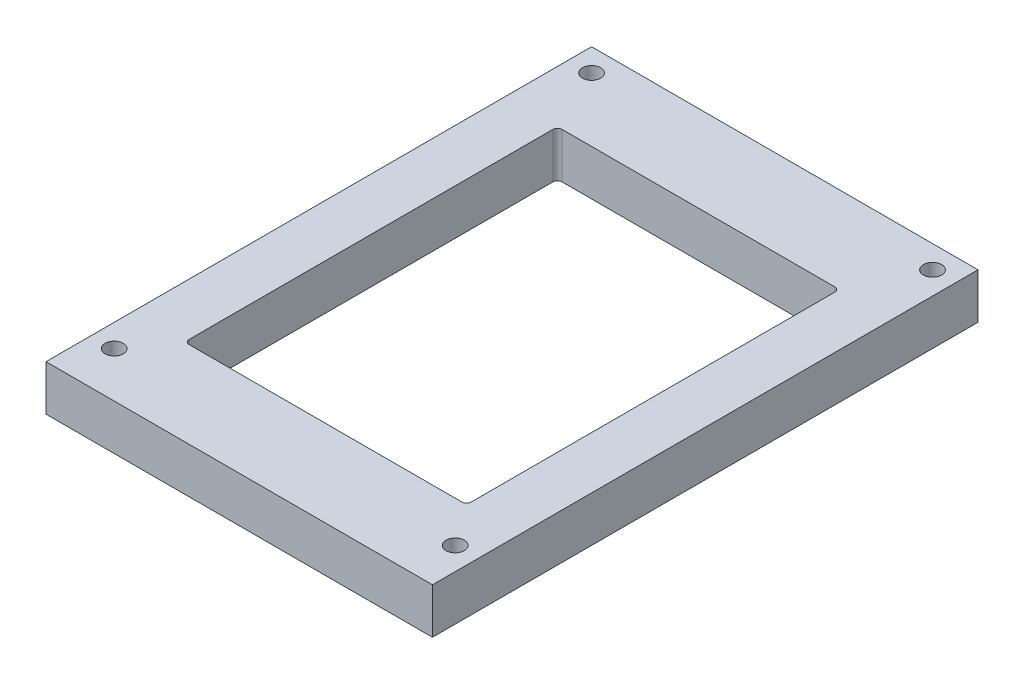
ISO-10303-21;
HEADER;
FILE_DESCRIPTION(('STEP AP214'),'2;1');
FILE_NAME('part.step','',(''),(''),'','','');
FILE_SCHEMA(('AUTOMOTIVE_DESIGN { 1 0 10303 214 1 1 1 1 }'));
ENDSEC;
DATA;
#1=APPLICATION_CONTEXT('core data for automotive mechanical design processes');
#2=APPLICATION_PROTOCOL_DEFINITION('international standard','automotive_design',2000,#1);
#3=PRODUCT_CONTEXT('',#1,'mechanical');
#4=PRODUCT('Part','Part','',(#3));
#5=PRODUCT_RELATED_PRODUCT_CATEGORY('part','',(#4));
#6=PRODUCT_DEFINITION_FORMATION('','',#4);
#7=PRODUCT_DEFINITION_CONTEXT('part definition',#1,'design');
#8=PRODUCT_DEFINITION('design','',#6,#7);
#9=PRODUCT_DEFINITION_SHAPE('','',#8);
#10=(LENGTH_UNIT() NAMED_UNIT(*) SI_UNIT(.MILLI.,.METRE.));
#11=(NAMED_UNIT(*) PLANE_ANGLE_UNIT() SI_UNIT($,.RADIAN.));
#12=(NAMED_UNIT(*) SI_UNIT($,.STERADIAN.) SOLID_ANGLE_UNIT());
#13=UNCERTAINTY_MEASURE_WITH_UNIT(LENGTH_MEASURE(1.E-05),#10,'distance_accuracy_value','');
#14=(GEOMETRIC_REPRESENTATION_CONTEXT(3) GLOBAL_UNCERTAINTY_ASSIGNED_CONTEXT((#13)) GLOBAL_UNIT_ASSIGNED_CONTEXT((#10,
#11,#12)) REPRESENTATION_CONTEXT('',''));
#15=CARTESIAN_POINT('',(0.,0.,0.));
#16=DIRECTION('',(0.,0.,1.));
#17=DIRECTION('',(1.,0.,0.));
#18=AXIS2_PLACEMENT_3D('',#15,#16,#17);
#19=CARTESIAN_POINT('',(42.5,10.,60.));
#20=DIRECTION('',(-1.,0.,0.));
#21=DIRECTION('',(0.,0.,1.));
#22=AXIS2_PLACEMENT_3D('',#19,#20,#21);
#23=PLANE('',#22);
#24=DIRECTION('',(0.,0.,-1.));
#25=VECTOR('',#24,1.);
#26=CARTESIAN_POINT('',(42.5,0.,60.));
#27=LINE('',#26,#25);
#28=CARTESIAN_POINT('',(42.5,0.,60.));
#29=VERTEX_POINT('',#28);
#30=CARTESIAN_POINT('',(42.5,0.,-60.));
#31=VERTEX_POINT('',#30);
#32=EDGE_CURVE('E148',#29,#31,#27,.T.);
#33=ORIENTED_EDGE('',*,*,#32,.T.);
#34=DIRECTION('',(0.,-1.,0.));
#35=VECTOR('',#34,1.);
#36=CARTESIAN_POINT('',(42.5,10.,-60.));
#37=LINE('',#36,#35);
#38=CARTESIAN_POINT('',(42.5,10.,-60.));
#39=VERTEX_POINT('',#38);
#40=EDGE_CURVE('E129',#39,#31,#37,.T.);
#41=ORIENTED_EDGE('',*,*,#40,.F.);
#42=DIRECTION('',(0.,0.,-1.));
#43=VECTOR('',#42,1.);
#44=CARTESIAN_POINT('',(42.5,10.,60.));
#45=LINE('',#44,#43);
#46=CARTESIAN_POINT('',(42.5,10.,60.));
#47=VERTEX_POINT('',#46);
#48=EDGE_CURVE('E136',#47,#39,#45,.T.);
#49=ORIENTED_EDGE('',*,*,#48,.F.);
#50=DIRECTION('',(0.,-1.,0.));
#51=VECTOR('',#50,1.);
#52=CARTESIAN_POINT('',(42.5,10.,60.));
#53=LINE('',#52,#51);
#54=EDGE_CURVE('E222',#47,#29,#53,.T.);
#55=ORIENTED_EDGE('',*,*,#54,.T.);
#56=EDGE_LOOP('',(#33,#41,#49,#55));
#57=FACE_BOUND('',#56,.T.);
#58=ADVANCED_FACE('F36',(#57),#23,.F.);
#59=CARTESIAN_POINT('',(-42.5,10.,-60.));
#60=DIRECTION('',(0.,0.,1.));
#61=DIRECTION('',(1.,0.,0.));
#62=AXIS2_PLACEMENT_3D('',#59,#60,#61);
#63=PLANE('',#62);
#64=DIRECTION('',(-1.,0.,0.));
#65=VECTOR('',#64,1.);
#66=CARTESIAN_POINT('',(-42.5,0.,-60.));
#67=LINE('',#66,#65);
#68=CARTESIAN_POINT('',(-42.5,0.,-60.));
#69=VERTEX_POINT('',#68);
#70=EDGE_CURVE('E224',#31,#69,#67,.T.);
#71=ORIENTED_EDGE('',*,*,#70,.T.);
#72=DIRECTION('',(0.,-1.,0.));
#73=VECTOR('',#72,1.);
#74=CARTESIAN_POINT('',(-42.5,10.,-60.));
#75=LINE('',#74,#73);
#76=CARTESIAN_POINT('',(-42.5,10.,-60.));
#77=VERTEX_POINT('',#76);
#78=EDGE_CURVE('E132',#77,#69,#75,.T.);
#79=ORIENTED_EDGE('',*,*,#78,.F.);
#80=DIRECTION('',(-1.,0.,0.));
#81=VECTOR('',#80,1.);
#82=CARTESIAN_POINT('',(-42.5,10.,-60.));
#83=LINE('',#82,#81);
#84=EDGE_CURVE('E125',#39,#77,#83,.T.);
#85=ORIENTED_EDGE('',*,*,#84,.F.);
#86=ORIENTED_EDGE('',*,*,#40,.T.);
#87=EDGE_LOOP('',(#71,#79,#85,#86));
#88=FACE_BOUND('',#87,.T.);
#89=ADVANCED_FACE('F127',(#88),#63,.F.);
#90=CARTESIAN_POINT('',(-42.5,10.,60.));
#91=DIRECTION('',(1.,0.,0.));
#92=DIRECTION('',(0.,0.,-1.));
#93=AXIS2_PLACEMENT_3D('',#90,#91,#92);
#94=PLANE('',#93);
#95=DIRECTION('',(0.,0.,1.));
#96=VECTOR('',#95,1.);
#97=CARTESIAN_POINT('',(-42.5,0.,60.));
#98=LINE('',#97,#96);
#99=CARTESIAN_POINT('',(-42.5,0.,60.));
#100=VERTEX_POINT('',#99);
#101=EDGE_CURVE('E226',#69,#100,#98,.T.);
#102=ORIENTED_EDGE('',*,*,#101,.T.);
#103=DIRECTION('',(0.,-1.,0.));
#104=VECTOR('',#103,1.);
#105=CARTESIAN_POINT('',(-42.5,10.,60.));
#106=LINE('',#105,#104);
#107=CARTESIAN_POINT('',(-42.5,10.,60.));
#108=VERTEX_POINT('',#107);
#109=EDGE_CURVE('E153',#108,#100,#106,.T.);
#110=ORIENTED_EDGE('',*,*,#109,.F.);
#111=DIRECTION('',(0.,0.,1.));
#112=VECTOR('',#111,1.);
#113=CARTESIAN_POINT('',(-42.5,10.,60.));
#114=LINE('',#113,#112);
#115=EDGE_CURVE('E135',#77,#108,#114,.T.);
#116=ORIENTED_EDGE('',*,*,#115,.F.);
#117=ORIENTED_EDGE('',*,*,#78,.T.);
#118=EDGE_LOOP('',(#102,#110,#116,#117));
#119=FACE_BOUND('',#118,.T.);
#120=ADVANCED_FACE('F238',(#119),#94,.F.);
#121=CARTESIAN_POINT('',(-42.5,10.,60.));
#122=DIRECTION('',(0.,0.,-1.));
#123=DIRECTION('',(-1.,0.,0.));
#124=AXIS2_PLACEMENT_3D('',#121,#122,#123);
#125=PLANE('',#124);
#126=DIRECTION('',(1.,0.,0.));
#127=VECTOR('',#126,1.);
#128=CARTESIAN_POINT('',(-42.5,0.,60.));
#129=LINE('',#128,#127);
#130=EDGE_CURVE('E145',#100,#29,#129,.T.);
#131=ORIENTED_EDGE('',*,*,#130,.T.);
#132=ORIENTED_EDGE('',*,*,#54,.F.);
#133=DIRECTION('',(1.,0.,0.));
#134=VECTOR('',#133,1.);
#135=CARTESIAN_POINT('',(-42.5,10.,60.));
#136=LINE('',#135,#134);
#137=EDGE_CURVE('E141',#108,#47,#136,.T.);
#138=ORIENTED_EDGE('',*,*,#137,.F.);
#139=ORIENTED_EDGE('',*,*,#109,.T.);
#140=EDGE_LOOP('',(#131,#132,#138,#139));
#141=FACE_BOUND('',#140,.T.);
#142=ADVANCED_FACE('F233',(#141),#125,.F.);
#143=CARTESIAN_POINT('',(0.,10.,0.));
#144=DIRECTION('',(0.,-1.,0.));
#145=DIRECTION('',(0.,0.,-1.));
#146=AXIS2_PLACEMENT_3D('',#143,#144,#145);
#147=PLANE('',#146);
#148=CARTESIAN_POINT('',(37.5,10.,50.));
#149=DIRECTION('',(0.,1.,0.));
#150=DIRECTION('',(0.,0.,1.));
#151=AXIS2_PLACEMENT_3D('',#148,#149,#150);
#152=CIRCLE('',#151,2.);
#153=CARTESIAN_POINT('',(37.5,10.,52.));
#154=VERTEX_POINT('',#153);
#155=EDGE_CURVE('E316',#154,#154,#152,.T.);
#156=ORIENTED_EDGE('',*,*,#155,.F.);
#157=EDGE_LOOP('',(#156));
#158=FACE_BOUND('',#157,.T.);
#159=CARTESIAN_POINT('',(37.5,10.,-55.));
#160=DIRECTION('',(0.,1.,0.));
#161=DIRECTION('',(0.,0.,1.));
#162=AXIS2_PLACEMENT_3D('',#159,#160,#161);
#163=CIRCLE('',#162,2.);
#164=CARTESIAN_POINT('',(37.5,10.,-53.));
#165=VERTEX_POINT('',#164);
#166=EDGE_CURVE('E338',#165,#165,#163,.T.);
#167=ORIENTED_EDGE('',*,*,#166,.F.);
#168=EDGE_LOOP('',(#167));
#169=FACE_BOUND('',#168,.T.);
#170=CARTESIAN_POINT('',(-37.5,10.,-55.));
#171=DIRECTION('',(0.,1.,0.));
#172=DIRECTION('',(0.,0.,1.));
#173=AXIS2_PLACEMENT_3D('',#170,#171,#172);
#174=CIRCLE('',#173,2.);
#175=CARTESIAN_POINT('',(-37.5,10.,-53.));
#176=VERTEX_POINT('',#175);
#177=EDGE_CURVE('E332',#176,#176,#174,.T.);
#178=ORIENTED_EDGE('',*,*,#177,.F.);
#179=EDGE_LOOP('',(#178));
#180=FACE_BOUND('',#179,.T.);
#181=CARTESIAN_POINT('',(-37.5,10.,50.));
#182=DIRECTION('',(0.,1.,0.));
#183=DIRECTION('',(0.,0.,1.));
#184=AXIS2_PLACEMENT_3D('',#181,#182,#183);
#185=CIRCLE('',#184,2.);
#186=CARTESIAN_POINT('',(-37.5,10.,52.));
#187=VERTEX_POINT('',#186);
#188=EDGE_CURVE('E331',#187,#187,#185,.T.);
#189=ORIENTED_EDGE('',*,*,#188,.F.);
#190=EDGE_LOOP('',(#189));
#191=FACE_BOUND('',#190,.T.);
#192=DIRECTION('',(-1.,0.,0.));
#193=VECTOR('',#192,1.);
#194=CARTESIAN_POINT('',(-31.,10.,-41.));
#195=LINE('',#194,#193);
#196=CARTESIAN_POINT('',(30.,10.,-41.));
#197=VERTEX_POINT('',#196);
#198=CARTESIAN_POINT('',(-30.,10.,-41.));
#199=VERTEX_POINT('',#198);
#200=EDGE_CURVE('E189',#197,#199,#195,.T.);
#201=ORIENTED_EDGE('',*,*,#200,.F.);
#202=CARTESIAN_POINT('',(30.,10.,-40.));
#203=DIRECTION('',(0.,-1.,0.));
#204=DIRECTION('',(0.,0.,-1.));
#205=AXIS2_PLACEMENT_3D('',#202,#203,#204);
#206=CIRCLE('',#205,1.);
#207=CARTESIAN_POINT('',(31.,10.,-40.));
#208=VERTEX_POINT('',#207);
#209=EDGE_CURVE('E44',#197,#208,#206,.T.);
#210=ORIENTED_EDGE('',*,*,#209,.T.);
#211=DIRECTION('',(0.,0.,-1.));
#212=VECTOR('',#211,1.);
#213=CARTESIAN_POINT('',(31.,10.,41.));
#214=LINE('',#213,#212);
#215=CARTESIAN_POINT('',(31.,10.,40.));
#216=VERTEX_POINT('',#215);
#217=EDGE_CURVE('E188',#216,#208,#214,.T.);
#218=ORIENTED_EDGE('',*,*,#217,.F.);
#219=CARTESIAN_POINT('',(30.,10.,40.));
#220=DIRECTION('',(0.,-1.,0.));
#221=DIRECTION('',(0.,0.,-1.));
#222=AXIS2_PLACEMENT_3D('',#219,#220,#221);
#223=CIRCLE('',#222,1.);
#224=CARTESIAN_POINT('',(30.,10.,41.));
#225=VERTEX_POINT('',#224);
#226=EDGE_CURVE('E173',#216,#225,#223,.T.);
#227=ORIENTED_EDGE('',*,*,#226,.T.);
#228=DIRECTION('',(1.,0.,0.));
#229=VECTOR('',#228,1.);
#230=CARTESIAN_POINT('',(-31.,10.,41.));
#231=LINE('',#230,#229);
#232=CARTESIAN_POINT('',(-30.,10.,41.));
#233=VERTEX_POINT('',#232);
#234=EDGE_CURVE('E208',#233,#225,#231,.T.);
#235=ORIENTED_EDGE('',*,*,#234,.F.);
#236=CARTESIAN_POINT('',(-30.,10.,40.));
#237=DIRECTION('',(0.,-1.,0.));
#238=DIRECTION('',(0.,0.,-1.));
#239=AXIS2_PLACEMENT_3D('',#236,#237,#238);
#240=CIRCLE('',#239,1.);
#241=CARTESIAN_POINT('',(-31.,10.,40.));
#242=VERTEX_POINT('',#241);
#243=EDGE_CURVE('E177',#233,#242,#240,.T.);
#244=ORIENTED_EDGE('',*,*,#243,.T.);
#245=DIRECTION('',(0.,0.,1.));
#246=VECTOR('',#245,1.);
#247=CARTESIAN_POINT('',(-31.,10.,41.));
#248=LINE('',#247,#246);
#249=CARTESIAN_POINT('',(-31.,10.,-40.));
#250=VERTEX_POINT('',#249);
#251=EDGE_CURVE('E215',#250,#242,#248,.T.);
#252=ORIENTED_EDGE('',*,*,#251,.F.);
#253=CARTESIAN_POINT('',(-30.,10.,-40.));
#254=DIRECTION('',(0.,-1.,0.));
#255=DIRECTION('',(0.,0.,-1.));
#256=AXIS2_PLACEMENT_3D('',#253,#254,#255);
#257=CIRCLE('',#256,1.);
#258=EDGE_CURVE('E181',#250,#199,#257,.T.);
#259=ORIENTED_EDGE('',*,*,#258,.T.);
#260=EDGE_LOOP('',(#201,#210,#218,#227,#235,#244,#252,#259));
#261=FACE_BOUND('',#260,.T.);
#262=ORIENTED_EDGE('',*,*,#48,.T.);
#263=ORIENTED_EDGE('',*,*,#84,.T.);
#264=ORIENTED_EDGE('',*,*,#115,.T.);
#265=ORIENTED_EDGE('',*,*,#137,.T.);
#266=EDGE_LOOP('',(#262,#263,#264,#265));
#267=FACE_BOUND('',#266,.T.);
#268=ADVANCED_FACE('F139',(#158,#169,#180,#191,#261,#267),#147,.F.);
#269=CARTESIAN_POINT('',(0.,0.,0.));
#270=DIRECTION('',(0.,-1.,0.));
#271=DIRECTION('',(0.,0.,-1.));
#272=AXIS2_PLACEMENT_3D('',#269,#270,#271);
#273=PLANE('',#272);
#274=CARTESIAN_POINT('',(-37.5,0.,-55.));
#275=DIRECTION('',(0.,1.,0.));
#276=DIRECTION('',(0.,0.,1.));
#277=AXIS2_PLACEMENT_3D('',#274,#275,#276);
#278=CIRCLE('',#277,0.999999999999998);
#279=CARTESIAN_POINT('',(-37.5,0.,-54.));
#280=VERTEX_POINT('',#279);
#281=EDGE_CURVE('E303',#280,#280,#278,.T.);
#282=ORIENTED_EDGE('',*,*,#281,.T.);
#283=EDGE_LOOP('',(#282));
#284=FACE_BOUND('',#283,.T.);
#285=CARTESIAN_POINT('',(37.5,0.,-55.));
#286=DIRECTION('',(0.,1.,0.));
#287=DIRECTION('',(0.,0.,1.));
#288=AXIS2_PLACEMENT_3D('',#285,#286,#287);
#289=CIRCLE('',#288,0.999999999999998);
#290=CARTESIAN_POINT('',(37.5,0.,-54.));
#291=VERTEX_POINT('',#290);
#292=EDGE_CURVE('E307',#291,#291,#289,.T.);
#293=ORIENTED_EDGE('',*,*,#292,.T.);
#294=EDGE_LOOP('',(#293));
#295=FACE_BOUND('',#294,.T.);
#296=CARTESIAN_POINT('',(37.5,0.,50.));
#297=DIRECTION('',(0.,1.,0.));
#298=DIRECTION('',(0.,0.,1.));
#299=AXIS2_PLACEMENT_3D('',#296,#297,#298);
#300=CIRCLE('',#299,0.999999999999998);
#301=CARTESIAN_POINT('',(37.5,0.,51.));
#302=VERTEX_POINT('',#301);
#303=EDGE_CURVE('E311',#302,#302,#300,.T.);
#304=ORIENTED_EDGE('',*,*,#303,.T.);
#305=EDGE_LOOP('',(#304));
#306=FACE_BOUND('',#305,.T.);
#307=CARTESIAN_POINT('',(-37.5,0.,50.));
#308=DIRECTION('',(0.,1.,0.));
#309=DIRECTION('',(0.,0.,1.));
#310=AXIS2_PLACEMENT_3D('',#307,#308,#309);
#311=CIRCLE('',#310,0.999999999999998);
#312=CARTESIAN_POINT('',(-37.5,0.,51.));
#313=VERTEX_POINT('',#312);
#314=EDGE_CURVE('E314',#313,#313,#311,.T.);
#315=ORIENTED_EDGE('',*,*,#314,.T.);
#316=EDGE_LOOP('',(#315));
#317=FACE_BOUND('',#316,.T.);
#318=DIRECTION('',(1.,0.,0.));
#319=VECTOR('',#318,1.);
#320=CARTESIAN_POINT('',(-31.,0.,41.));
#321=LINE('',#320,#319);
#322=CARTESIAN_POINT('',(-30.,0.,41.));
#323=VERTEX_POINT('',#322);
#324=CARTESIAN_POINT('',(30.,0.,41.));
#325=VERTEX_POINT('',#324);
#326=EDGE_CURVE('E206',#323,#325,#321,.T.);
#327=ORIENTED_EDGE('',*,*,#326,.T.);
#328=CARTESIAN_POINT('',(30.,0.,40.));
#329=DIRECTION('',(0.,-1.,0.));
#330=DIRECTION('',(0.,0.,-1.));
#331=AXIS2_PLACEMENT_3D('',#328,#329,#330);
#332=CIRCLE('',#331,1.);
#333=CARTESIAN_POINT('',(31.,0.,40.));
#334=VERTEX_POINT('',#333);
#335=EDGE_CURVE('E175',#325,#334,#332,.F.);
#336=ORIENTED_EDGE('',*,*,#335,.T.);
#337=DIRECTION('',(0.,0.,-1.));
#338=VECTOR('',#337,1.);
#339=CARTESIAN_POINT('',(31.,0.,41.));
#340=LINE('',#339,#338);
#341=CARTESIAN_POINT('',(31.,0.,-40.));
#342=VERTEX_POINT('',#341);
#343=EDGE_CURVE('E203',#334,#342,#340,.T.);
#344=ORIENTED_EDGE('',*,*,#343,.T.);
#345=CARTESIAN_POINT('',(30.,0.,-40.));
#346=DIRECTION('',(0.,-1.,0.));
#347=DIRECTION('',(0.,0.,-1.));
#348=AXIS2_PLACEMENT_3D('',#345,#346,#347);
#349=CIRCLE('',#348,1.);
#350=CARTESIAN_POINT('',(30.,0.,-41.));
#351=VERTEX_POINT('',#350);
#352=EDGE_CURVE('E11',#342,#351,#349,.F.);
#353=ORIENTED_EDGE('',*,*,#352,.T.);
#354=DIRECTION('',(-1.,0.,0.));
#355=VECTOR('',#354,1.);
#356=CARTESIAN_POINT('',(-31.,0.,-41.));
#357=LINE('',#356,#355);
#358=CARTESIAN_POINT('',(-30.,0.,-41.));
#359=VERTEX_POINT('',#358);
#360=EDGE_CURVE('E200',#351,#359,#357,.T.);
#361=ORIENTED_EDGE('',*,*,#360,.T.);
#362=CARTESIAN_POINT('',(-30.,0.,-40.));
#363=DIRECTION('',(0.,-1.,0.));
#364=DIRECTION('',(0.,0.,-1.));
#365=AXIS2_PLACEMENT_3D('',#362,#363,#364);
#366=CIRCLE('',#365,1.);
#367=CARTESIAN_POINT('',(-31.,0.,-40.));
#368=VERTEX_POINT('',#367);
#369=EDGE_CURVE('E183',#359,#368,#366,.F.);
#370=ORIENTED_EDGE('',*,*,#369,.T.);
#371=DIRECTION('',(0.,0.,1.));
#372=VECTOR('',#371,1.);
#373=CARTESIAN_POINT('',(-31.,0.,41.));
#374=LINE('',#373,#372);
#375=CARTESIAN_POINT('',(-31.,0.,40.));
#376=VERTEX_POINT('',#375);
#377=EDGE_CURVE('E202',#368,#376,#374,.T.);
#378=ORIENTED_EDGE('',*,*,#377,.T.);
#379=CARTESIAN_POINT('',(-30.,0.,40.));
#380=DIRECTION('',(0.,-1.,0.));
#381=DIRECTION('',(0.,0.,-1.));
#382=AXIS2_PLACEMENT_3D('',#379,#380,#381);
#383=CIRCLE('',#382,1.);
#384=EDGE_CURVE('E179',#376,#323,#383,.F.);
#385=ORIENTED_EDGE('',*,*,#384,.T.);
#386=EDGE_LOOP('',(#327,#336,#344,#353,#361,#370,#378,#385));
#387=FACE_BOUND('',#386,.T.);
#388=ORIENTED_EDGE('',*,*,#32,.F.);
#389=ORIENTED_EDGE('',*,*,#130,.F.);
#390=ORIENTED_EDGE('',*,*,#101,.F.);
#391=ORIENTED_EDGE('',*,*,#70,.F.);
#392=EDGE_LOOP('',(#388,#389,#390,#391));
#393=FACE_BOUND('',#392,.T.);
#394=ADVANCED_FACE('F237',(#284,#295,#306,#317,#387,#393),#273,.T.);
#395=CARTESIAN_POINT('',(31.,0.,41.));
#396=DIRECTION('',(1.,0.,0.));
#397=DIRECTION('',(0.,0.,-1.));
#398=AXIS2_PLACEMENT_3D('',#395,#396,#397);
#399=PLANE('',#398);
#400=ORIENTED_EDGE('',*,*,#343,.F.);
#401=DIRECTION('',(0.,1.,0.));
#402=VECTOR('',#401,1.);
#403=CARTESIAN_POINT('',(31.,10.,40.));
#404=LINE('',#403,#402);
#405=EDGE_CURVE('E151',#334,#216,#404,.T.);
#406=ORIENTED_EDGE('',*,*,#405,.T.);
#407=ORIENTED_EDGE('',*,*,#217,.T.);
#408=DIRECTION('',(0.,1.,0.));
#409=VECTOR('',#408,1.);
#410=CARTESIAN_POINT('',(31.,0.,-40.));
#411=LINE('',#410,#409);
#412=EDGE_CURVE('E149',#208,#342,#411,.F.);
#413=ORIENTED_EDGE('',*,*,#412,.T.);
#414=EDGE_LOOP('',(#400,#406,#407,#413));
#415=FACE_BOUND('',#414,.T.);
#416=ADVANCED_FACE('F195',(#415),#399,.F.);
#417=CARTESIAN_POINT('',(-31.,0.,41.));
#418=DIRECTION('',(0.,0.,1.));
#419=DIRECTION('',(1.,0.,0.));
#420=AXIS2_PLACEMENT_3D('',#417,#418,#419);
#421=PLANE('',#420);
#422=ORIENTED_EDGE('',*,*,#234,.T.);
#423=DIRECTION('',(0.,1.,0.));
#424=VECTOR('',#423,1.);
#425=CARTESIAN_POINT('',(30.,0.,41.));
#426=LINE('',#425,#424);
#427=EDGE_CURVE('E162',#225,#325,#426,.F.);
#428=ORIENTED_EDGE('',*,*,#427,.T.);
#429=ORIENTED_EDGE('',*,*,#326,.F.);
#430=DIRECTION('',(0.,1.,0.));
#431=VECTOR('',#430,1.);
#432=CARTESIAN_POINT('',(-30.,10.,41.));
#433=LINE('',#432,#431);
#434=EDGE_CURVE('E159',#323,#233,#433,.T.);
#435=ORIENTED_EDGE('',*,*,#434,.T.);
#436=EDGE_LOOP('',(#422,#428,#429,#435));
#437=FACE_BOUND('',#436,.T.);
#438=ADVANCED_FACE('F277',(#437),#421,.F.);
#439=CARTESIAN_POINT('',(-31.,0.,41.));
#440=DIRECTION('',(-1.,0.,0.));
#441=DIRECTION('',(0.,0.,1.));
#442=AXIS2_PLACEMENT_3D('',#439,#440,#441);
#443=PLANE('',#442);
#444=ORIENTED_EDGE('',*,*,#251,.T.);
#445=DIRECTION('',(0.,1.,0.));
#446=VECTOR('',#445,1.);
#447=CARTESIAN_POINT('',(-31.,0.,40.));
#448=LINE('',#447,#446);
#449=EDGE_CURVE('E167',#242,#376,#448,.F.);
#450=ORIENTED_EDGE('',*,*,#449,.T.);
#451=ORIENTED_EDGE('',*,*,#377,.F.);
#452=DIRECTION('',(0.,1.,0.));
#453=VECTOR('',#452,1.);
#454=CARTESIAN_POINT('',(-31.,10.,-40.));
#455=LINE('',#454,#453);
#456=EDGE_CURVE('E164',#368,#250,#455,.T.);
#457=ORIENTED_EDGE('',*,*,#456,.T.);
#458=EDGE_LOOP('',(#444,#450,#451,#457));
#459=FACE_BOUND('',#458,.T.);
#460=ADVANCED_FACE('F270',(#459),#443,.F.);
#461=CARTESIAN_POINT('',(-31.,0.,-41.));
#462=DIRECTION('',(0.,0.,-1.));
#463=DIRECTION('',(-1.,0.,0.));
#464=AXIS2_PLACEMENT_3D('',#461,#462,#463);
#465=PLANE('',#464);
#466=ORIENTED_EDGE('',*,*,#200,.T.);
#467=DIRECTION('',(0.,1.,0.));
#468=VECTOR('',#467,1.);
#469=CARTESIAN_POINT('',(-30.,0.,-41.));
#470=LINE('',#469,#468);
#471=EDGE_CURVE('E51',#199,#359,#470,.F.);
#472=ORIENTED_EDGE('',*,*,#471,.T.);
#473=ORIENTED_EDGE('',*,*,#360,.F.);
#474=DIRECTION('',(0.,1.,0.));
#475=VECTOR('',#474,1.);
#476=CARTESIAN_POINT('',(30.,10.,-41.));
#477=LINE('',#476,#475);
#478=EDGE_CURVE('E169',#351,#197,#477,.T.);
#479=ORIENTED_EDGE('',*,*,#478,.T.);
#480=EDGE_LOOP('',(#466,#472,#473,#479));
#481=FACE_BOUND('',#480,.T.);
#482=ADVANCED_FACE('F199',(#481),#465,.F.);
#483=CARTESIAN_POINT('',(30.,0.,40.));
#484=DIRECTION('',(0.,-1.,0.));
#485=DIRECTION('',(0.,0.,-1.));
#486=AXIS2_PLACEMENT_3D('',#483,#484,#485);
#487=CYLINDRICAL_SURFACE('',#486,1.);
#488=ORIENTED_EDGE('',*,*,#335,.F.);
#489=ORIENTED_EDGE('',*,*,#427,.F.);
#490=ORIENTED_EDGE('',*,*,#226,.F.);
#491=ORIENTED_EDGE('',*,*,#405,.F.);
#492=EDGE_LOOP('',(#488,#489,#490,#491));
#493=FACE_BOUND('',#492,.T.);
#494=ADVANCED_FACE('F252',(#493),#487,.F.);
#495=CARTESIAN_POINT('',(-30.,0.,40.));
#496=DIRECTION('',(0.,-1.,0.));
#497=DIRECTION('',(0.,0.,-1.));
#498=AXIS2_PLACEMENT_3D('',#495,#496,#497);
#499=CYLINDRICAL_SURFACE('',#498,1.);
#500=ORIENTED_EDGE('',*,*,#384,.F.);
#501=ORIENTED_EDGE('',*,*,#449,.F.);
#502=ORIENTED_EDGE('',*,*,#243,.F.);
#503=ORIENTED_EDGE('',*,*,#434,.F.);
#504=EDGE_LOOP('',(#500,#501,#502,#503));
#505=FACE_BOUND('',#504,.T.);
#506=ADVANCED_FACE('F255',(#505),#499,.F.);
#507=CARTESIAN_POINT('',(-30.,0.,-40.));
#508=DIRECTION('',(0.,-1.,0.));
#509=DIRECTION('',(0.,0.,-1.));
#510=AXIS2_PLACEMENT_3D('',#507,#508,#509);
#511=CYLINDRICAL_SURFACE('',#510,1.);
#512=ORIENTED_EDGE('',*,*,#369,.F.);
#513=ORIENTED_EDGE('',*,*,#471,.F.);
#514=ORIENTED_EDGE('',*,*,#258,.F.);
#515=ORIENTED_EDGE('',*,*,#456,.F.);
#516=EDGE_LOOP('',(#512,#513,#514,#515));
#517=FACE_BOUND('',#516,.T.);
#518=ADVANCED_FACE('F258',(#517),#511,.F.);
#519=CARTESIAN_POINT('',(30.,0.,-40.));
#520=DIRECTION('',(0.,-1.,0.));
#521=DIRECTION('',(0.,0.,-1.));
#522=AXIS2_PLACEMENT_3D('',#519,#520,#521);
#523=CYLINDRICAL_SURFACE('',#522,1.);
#524=ORIENTED_EDGE('',*,*,#352,.F.);
#525=ORIENTED_EDGE('',*,*,#412,.F.);
#526=ORIENTED_EDGE('',*,*,#209,.F.);
#527=ORIENTED_EDGE('',*,*,#478,.F.);
#528=EDGE_LOOP('',(#524,#525,#526,#527));
#529=FACE_BOUND('',#528,.T.);
#530=ADVANCED_FACE('F38',(#529),#523,.F.);
#531=CARTESIAN_POINT('',(-37.5,5.,50.));
#532=DIRECTION('',(0.,1.,0.));
#533=DIRECTION('',(0.,0.,1.));
#534=AXIS2_PLACEMENT_3D('',#531,#532,#533);
#535=CYLINDRICAL_SURFACE('',#534,2.);
#536=CARTESIAN_POINT('',(-37.5,5.,50.));
#537=DIRECTION('',(0.,1.,0.));
#538=DIRECTION('',(0.,0.,1.));
#539=AXIS2_PLACEMENT_3D('',#536,#537,#538);
#540=CIRCLE('',#539,2.);
#541=CARTESIAN_POINT('',(-37.5,5.,52.));
#542=VERTEX_POINT('',#541);
#543=EDGE_CURVE('E197',#542,#542,#540,.T.);
#544=ORIENTED_EDGE('',*,*,#543,.F.);
#545=EDGE_LOOP('',(#544));
#546=FACE_BOUND('',#545,.T.);
#547=ORIENTED_EDGE('',*,*,#188,.T.);
#548=EDGE_LOOP('',(#547));
#549=FACE_BOUND('',#548,.T.);
#550=ADVANCED_FACE('F265',(#546,#549),#535,.F.);
#551=CARTESIAN_POINT('',(-37.5,5.,50.));
#552=DIRECTION('',(0.,1.,0.));
#553=DIRECTION('',(0.,0.,1.));
#554=AXIS2_PLACEMENT_3D('',#551,#552,#553);
#555=PLANE('',#554);
#556=CARTESIAN_POINT('',(-37.5,5.,50.));
#557=DIRECTION('',(0.,1.,0.));
#558=DIRECTION('',(0.,0.,1.));
#559=AXIS2_PLACEMENT_3D('',#556,#557,#558);
#560=CIRCLE('',#559,0.999999999999998);
#561=CARTESIAN_POINT('',(-37.5,5.,51.));
#562=VERTEX_POINT('',#561);
#563=EDGE_CURVE('E317',#562,#562,#560,.T.);
#564=ORIENTED_EDGE('',*,*,#563,.F.);
#565=EDGE_LOOP('',(#564));
#566=FACE_BOUND('',#565,.T.);
#567=ORIENTED_EDGE('',*,*,#543,.T.);
#568=EDGE_LOOP('',(#567));
#569=FACE_BOUND('',#568,.T.);
#570=ADVANCED_FACE('F349',(#566,#569),#555,.T.);
#571=CARTESIAN_POINT('',(-37.5,5.,-55.));
#572=DIRECTION('',(0.,1.,0.));
#573=DIRECTION('',(0.,0.,1.));
#574=AXIS2_PLACEMENT_3D('',#571,#572,#573);
#575=CYLINDRICAL_SURFACE('',#574,2.);
#576=CARTESIAN_POINT('',(-37.5,5.,-55.));
#577=DIRECTION('',(0.,1.,0.));
#578=DIRECTION('',(0.,0.,1.));
#579=AXIS2_PLACEMENT_3D('',#576,#577,#578);
#580=CIRCLE('',#579,2.);
#581=CARTESIAN_POINT('',(-37.5,5.,-53.));
#582=VERTEX_POINT('',#581);
#583=EDGE_CURVE('E328',#582,#582,#580,.T.);
#584=ORIENTED_EDGE('',*,*,#583,.F.);
#585=EDGE_LOOP('',(#584));
#586=FACE_BOUND('',#585,.T.);
#587=ORIENTED_EDGE('',*,*,#177,.T.);
#588=EDGE_LOOP('',(#587));
#589=FACE_BOUND('',#588,.T.);
#590=ADVANCED_FACE('F354',(#586,#589),#575,.F.);
#591=CARTESIAN_POINT('',(-37.5,5.,-55.));
#592=DIRECTION('',(0.,1.,0.));
#593=DIRECTION('',(0.,0.,1.));
#594=AXIS2_PLACEMENT_3D('',#591,#592,#593);
#595=PLANE('',#594);
#596=CARTESIAN_POINT('',(-37.5,5.,-55.));
#597=DIRECTION('',(0.,1.,0.));
#598=DIRECTION('',(0.,0.,1.));
#599=AXIS2_PLACEMENT_3D('',#596,#597,#598);
#600=CIRCLE('',#599,0.999999999999998);
#601=CARTESIAN_POINT('',(-37.5,5.,-54.));
#602=VERTEX_POINT('',#601);
#603=EDGE_CURVE('E325',#602,#602,#600,.T.);
#604=ORIENTED_EDGE('',*,*,#603,.F.);
#605=EDGE_LOOP('',(#604));
#606=FACE_BOUND('',#605,.T.);
#607=ORIENTED_EDGE('',*,*,#583,.T.);
#608=EDGE_LOOP('',(#607));
#609=FACE_BOUND('',#608,.T.);
#610=ADVANCED_FACE('F361',(#606,#609),#595,.T.);
#611=CARTESIAN_POINT('',(37.5,5.,-55.));
#612=DIRECTION('',(0.,1.,0.));
#613=DIRECTION('',(0.,0.,1.));
#614=AXIS2_PLACEMENT_3D('',#611,#612,#613);
#615=CYLINDRICAL_SURFACE('',#614,2.);
#616=CARTESIAN_POINT('',(37.5,5.,-55.));
#617=DIRECTION('',(0.,1.,0.));
#618=DIRECTION('',(0.,0.,1.));
#619=AXIS2_PLACEMENT_3D('',#616,#617,#618);
#620=CIRCLE('',#619,2.);
#621=CARTESIAN_POINT('',(37.5,5.,-53.));
#622=VERTEX_POINT('',#621);
#623=EDGE_CURVE('E335',#622,#622,#620,.T.);
#624=ORIENTED_EDGE('',*,*,#623,.F.);
#625=EDGE_LOOP('',(#624));
#626=FACE_BOUND('',#625,.T.);
#627=ORIENTED_EDGE('',*,*,#166,.T.);
#628=EDGE_LOOP('',(#627));
#629=FACE_BOUND('',#628,.T.);
#630=ADVANCED_FACE('F376',(#626,#629),#615,.F.);
#631=CARTESIAN_POINT('',(37.5,5.,-55.));
#632=DIRECTION('',(0.,1.,0.));
#633=DIRECTION('',(0.,0.,1.));
#634=AXIS2_PLACEMENT_3D('',#631,#632,#633);
#635=PLANE('',#634);
#636=CARTESIAN_POINT('',(37.5,5.,-55.));
#637=DIRECTION('',(0.,1.,0.));
#638=DIRECTION('',(0.,0.,1.));
#639=AXIS2_PLACEMENT_3D('',#636,#637,#638);
#640=CIRCLE('',#639,0.999999999999998);
#641=CARTESIAN_POINT('',(37.5,5.,-54.));
#642=VERTEX_POINT('',#641);
#643=EDGE_CURVE('E407',#642,#642,#640,.T.);
#644=ORIENTED_EDGE('',*,*,#643,.F.);
#645=EDGE_LOOP('',(#644));
#646=FACE_BOUND('',#645,.T.);
#647=ORIENTED_EDGE('',*,*,#623,.T.);
#648=EDGE_LOOP('',(#647));
#649=FACE_BOUND('',#648,.T.);
#650=ADVANCED_FACE('F370',(#646,#649),#635,.T.);
#651=CARTESIAN_POINT('',(37.5,5.,50.));
#652=DIRECTION('',(0.,1.,0.));
#653=DIRECTION('',(0.,0.,1.));
#654=AXIS2_PLACEMENT_3D('',#651,#652,#653);
#655=CYLINDRICAL_SURFACE('',#654,2.);
#656=CARTESIAN_POINT('',(37.5,5.,50.));
#657=DIRECTION('',(0.,1.,0.));
#658=DIRECTION('',(0.,0.,1.));
#659=AXIS2_PLACEMENT_3D('',#656,#657,#658);
#660=CIRCLE('',#659,2.);
#661=CARTESIAN_POINT('',(37.5,5.,52.));
#662=VERTEX_POINT('',#661);
#663=EDGE_CURVE('E320',#662,#662,#660,.T.);
#664=ORIENTED_EDGE('',*,*,#663,.F.);
#665=EDGE_LOOP('',(#664));
#666=FACE_BOUND('',#665,.T.);
#667=ORIENTED_EDGE('',*,*,#155,.T.);
#668=EDGE_LOOP('',(#667));
#669=FACE_BOUND('',#668,.T.);
#670=ADVANCED_FACE('F366',(#666,#669),#655,.F.);
#671=CARTESIAN_POINT('',(37.5,5.,50.));
#672=DIRECTION('',(0.,1.,0.));
#673=DIRECTION('',(0.,0.,1.));
#674=AXIS2_PLACEMENT_3D('',#671,#672,#673);
#675=PLANE('',#674);
#676=CARTESIAN_POINT('',(37.5,5.,50.));
#677=DIRECTION('',(0.,1.,0.));
#678=DIRECTION('',(0.,0.,1.));
#679=AXIS2_PLACEMENT_3D('',#676,#677,#678);
#680=CIRCLE('',#679,0.999999999999998);
#681=CARTESIAN_POINT('',(37.5,5.,51.));
#682=VERTEX_POINT('',#681);
#683=EDGE_CURVE('E404',#682,#682,#680,.T.);
#684=ORIENTED_EDGE('',*,*,#683,.F.);
#685=EDGE_LOOP('',(#684));
#686=FACE_BOUND('',#685,.T.);
#687=ORIENTED_EDGE('',*,*,#663,.T.);
#688=EDGE_LOOP('',(#687));
#689=FACE_BOUND('',#688,.T.);
#690=ADVANCED_FACE('F369',(#686,#689),#675,.T.);
#691=CARTESIAN_POINT('',(-37.5,0.,50.));
#692=DIRECTION('',(0.,1.,0.));
#693=DIRECTION('',(0.,0.,1.));
#694=AXIS2_PLACEMENT_3D('',#691,#692,#693);
#695=CYLINDRICAL_SURFACE('',#694,0.999999999999998);
#696=ORIENTED_EDGE('',*,*,#314,.F.);
#697=EDGE_LOOP('',(#696));
#698=FACE_BOUND('',#697,.T.);
#699=ORIENTED_EDGE('',*,*,#563,.T.);
#700=EDGE_LOOP('',(#699));
#701=FACE_BOUND('',#700,.T.);
#702=ADVANCED_FACE('F374',(#698,#701),#695,.F.);
#703=CARTESIAN_POINT('',(37.5,0.,50.));
#704=DIRECTION('',(0.,1.,0.));
#705=DIRECTION('',(0.,0.,1.));
#706=AXIS2_PLACEMENT_3D('',#703,#704,#705);
#707=CYLINDRICAL_SURFACE('',#706,0.999999999999998);
#708=ORIENTED_EDGE('',*,*,#303,.F.);
#709=EDGE_LOOP('',(#708));
#710=FACE_BOUND('',#709,.T.);
#711=ORIENTED_EDGE('',*,*,#683,.T.);
#712=EDGE_LOOP('',(#711));
#713=FACE_BOUND('',#712,.T.);
#714=ADVANCED_FACE('F388',(#710,#713),#707,.F.);
#715=CARTESIAN_POINT('',(37.5,0.,-55.));
#716=DIRECTION('',(0.,1.,0.));
#717=DIRECTION('',(0.,0.,1.));
#718=AXIS2_PLACEMENT_3D('',#715,#716,#717);
#719=CYLINDRICAL_SURFACE('',#718,0.999999999999998);
#720=ORIENTED_EDGE('',*,*,#292,.F.);
#721=EDGE_LOOP('',(#720));
#722=FACE_BOUND('',#721,.T.);
#723=ORIENTED_EDGE('',*,*,#643,.T.);
#724=EDGE_LOOP('',(#723));
#725=FACE_BOUND('',#724,.T.);
#726=ADVANCED_FACE('F392',(#722,#725),#719,.F.);
#727=CARTESIAN_POINT('',(-37.5,0.,-55.));
#728=DIRECTION('',(0.,1.,0.));
#729=DIRECTION('',(0.,0.,1.));
#730=AXIS2_PLACEMENT_3D('',#727,#728,#729);
#731=CYLINDRICAL_SURFACE('',#730,0.999999999999998);
#732=ORIENTED_EDGE('',*,*,#281,.F.);
#733=EDGE_LOOP('',(#732));
#734=FACE_BOUND('',#733,.T.);
#735=ORIENTED_EDGE('',*,*,#603,.T.);
#736=EDGE_LOOP('',(#735));
#737=FACE_BOUND('',#736,.T.);
#738=ADVANCED_FACE('F389',(#734,#737),#731,.F.);
#739=CLOSED_SHELL('',(#58,#89,#120,#142,#268,#394,#416,#438,#460,#482,#494,#506,#518,#530,#550,
#570,#590,#610,#630,#650,#670,#690,#702,#714,#726,#738));
#740=MANIFOLD_SOLID_BREP('B2',#739);
#741=ADVANCED_BREP_SHAPE_REPRESENTATION('',(#18,#740),#14);
#742=SHAPE_DEFINITION_REPRESENTATION(#9,#741);
ENDSEC;
END-ISO-10303-21;
